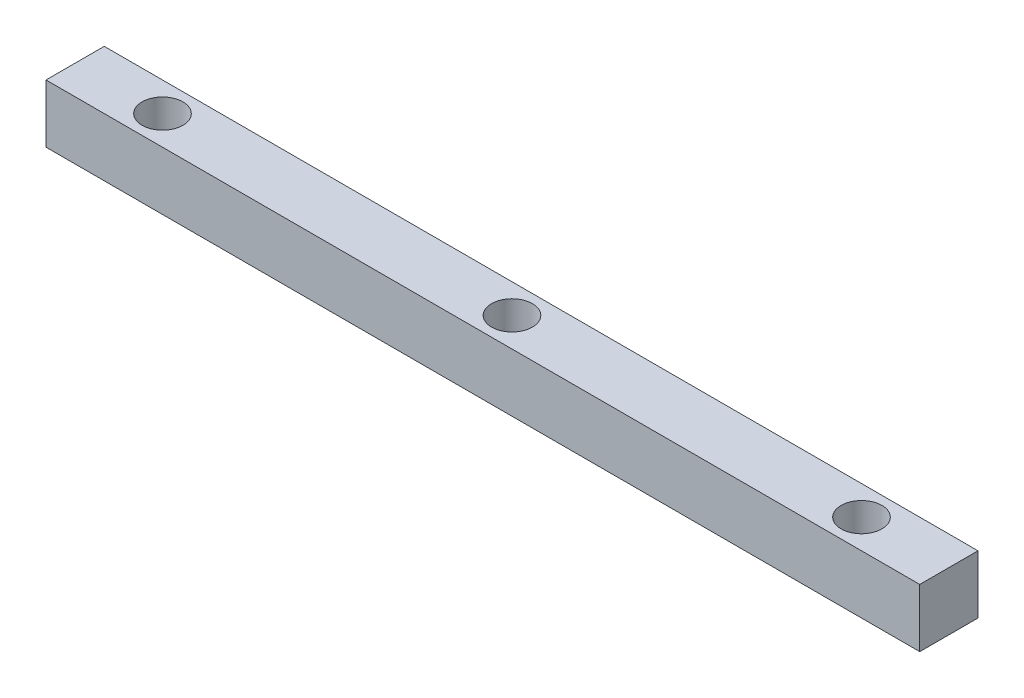
ISO-10303-21;
HEADER;
FILE_DESCRIPTION(('STEP AP214'),'2;1');
FILE_NAME('part.step','',(''),(''),'','','');
FILE_SCHEMA(('AUTOMOTIVE_DESIGN { 1 0 10303 214 1 1 1 1 }'));
ENDSEC;
DATA;
#1=APPLICATION_CONTEXT('core data for automotive mechanical design processes');
#2=APPLICATION_PROTOCOL_DEFINITION('international standard','automotive_design',2000,#1);
#3=PRODUCT_CONTEXT('',#1,'mechanical');
#4=PRODUCT('Part','Part','',(#3));
#5=PRODUCT_RELATED_PRODUCT_CATEGORY('part','',(#4));
#6=PRODUCT_DEFINITION_FORMATION('','',#4);
#7=PRODUCT_DEFINITION_CONTEXT('part definition',#1,'design');
#8=PRODUCT_DEFINITION('design','',#6,#7);
#9=PRODUCT_DEFINITION_SHAPE('','',#8);
#10=(LENGTH_UNIT() NAMED_UNIT(*) SI_UNIT(.MILLI.,.METRE.));
#11=(NAMED_UNIT(*) PLANE_ANGLE_UNIT() SI_UNIT($,.RADIAN.));
#12=(NAMED_UNIT(*) SI_UNIT($,.STERADIAN.) SOLID_ANGLE_UNIT());
#13=UNCERTAINTY_MEASURE_WITH_UNIT(LENGTH_MEASURE(1.E-05),#10,'distance_accuracy_value','');
#14=(GEOMETRIC_REPRESENTATION_CONTEXT(3) GLOBAL_UNCERTAINTY_ASSIGNED_CONTEXT((#13)) GLOBAL_UNIT_ASSIGNED_CONTEXT((#10,
#11,#12)) REPRESENTATION_CONTEXT('',''));
#15=CARTESIAN_POINT('',(0.,0.,0.));
#16=DIRECTION('',(0.,0.,1.));
#17=DIRECTION('',(1.,0.,0.));
#18=AXIS2_PLACEMENT_3D('',#15,#16,#17);
#19=CARTESIAN_POINT('',(0.,10.,0.));
#20=DIRECTION('',(1.,0.,0.));
#21=DIRECTION('',(0.,0.,-1.));
#22=AXIS2_PLACEMENT_3D('',#19,#20,#21);
#23=PLANE('',#22);
#24=DIRECTION('',(0.,0.,1.));
#25=VECTOR('',#24,1.);
#26=CARTESIAN_POINT('',(0.,0.,0.));
#27=LINE('',#26,#25);
#28=CARTESIAN_POINT('',(0.,0.,0.));
#29=VERTEX_POINT('',#28);
#30=CARTESIAN_POINT('',(0.,0.,10.));
#31=VERTEX_POINT('',#30);
#32=EDGE_CURVE('E96',#29,#31,#27,.T.);
#33=ORIENTED_EDGE('',*,*,#32,.T.);
#34=DIRECTION('',(0.,-1.,0.));
#35=VECTOR('',#34,1.);
#36=CARTESIAN_POINT('',(0.,10.,10.));
#37=LINE('',#36,#35);
#38=CARTESIAN_POINT('',(0.,10.,10.));
#39=VERTEX_POINT('',#38);
#40=EDGE_CURVE('E11',#39,#31,#37,.T.);
#41=ORIENTED_EDGE('',*,*,#40,.F.);
#42=DIRECTION('',(0.,0.,1.));
#43=VECTOR('',#42,1.);
#44=CARTESIAN_POINT('',(0.,10.,0.));
#45=LINE('',#44,#43);
#46=CARTESIAN_POINT('',(0.,10.,0.));
#47=VERTEX_POINT('',#46);
#48=EDGE_CURVE('E84',#47,#39,#45,.T.);
#49=ORIENTED_EDGE('',*,*,#48,.F.);
#50=DIRECTION('',(0.,-1.,0.));
#51=VECTOR('',#50,1.);
#52=CARTESIAN_POINT('',(0.,10.,0.));
#53=LINE('',#52,#51);
#54=EDGE_CURVE('E92',#47,#29,#53,.T.);
#55=ORIENTED_EDGE('',*,*,#54,.T.);
#56=EDGE_LOOP('',(#33,#41,#49,#55));
#57=FACE_BOUND('',#56,.T.);
#58=ADVANCED_FACE('F33',(#57),#23,.F.);
#59=CARTESIAN_POINT('',(0.,10.,10.));
#60=DIRECTION('',(0.,0.,-1.));
#61=DIRECTION('',(-1.,0.,0.));
#62=AXIS2_PLACEMENT_3D('',#59,#60,#61);
#63=PLANE('',#62);
#64=DIRECTION('',(1.,0.,0.));
#65=VECTOR('',#64,1.);
#66=CARTESIAN_POINT('',(0.,0.,10.));
#67=LINE('',#66,#65);
#68=CARTESIAN_POINT('',(150.,0.,10.));
#69=VERTEX_POINT('',#68);
#70=EDGE_CURVE('E88',#31,#69,#67,.T.);
#71=ORIENTED_EDGE('',*,*,#70,.T.);
#72=DIRECTION('',(0.,-1.,0.));
#73=VECTOR('',#72,1.);
#74=CARTESIAN_POINT('',(150.,10.,10.));
#75=LINE('',#74,#73);
#76=CARTESIAN_POINT('',(150.,10.,10.));
#77=VERTEX_POINT('',#76);
#78=EDGE_CURVE('E41',#77,#69,#75,.T.);
#79=ORIENTED_EDGE('',*,*,#78,.F.);
#80=DIRECTION('',(1.,0.,0.));
#81=VECTOR('',#80,1.);
#82=CARTESIAN_POINT('',(0.,10.,10.));
#83=LINE('',#82,#81);
#84=EDGE_CURVE('E79',#39,#77,#83,.T.);
#85=ORIENTED_EDGE('',*,*,#84,.F.);
#86=ORIENTED_EDGE('',*,*,#40,.T.);
#87=EDGE_LOOP('',(#71,#79,#85,#86));
#88=FACE_BOUND('',#87,.T.);
#89=ADVANCED_FACE('F87',(#88),#63,.F.);
#90=CARTESIAN_POINT('',(150.,10.,0.));
#91=DIRECTION('',(-1.,0.,0.));
#92=DIRECTION('',(0.,0.,1.));
#93=AXIS2_PLACEMENT_3D('',#90,#91,#92);
#94=PLANE('',#93);
#95=DIRECTION('',(0.,0.,-1.));
#96=VECTOR('',#95,1.);
#97=CARTESIAN_POINT('',(150.,0.,0.));
#98=LINE('',#97,#96);
#99=CARTESIAN_POINT('',(150.,0.,0.));
#100=VERTEX_POINT('',#99);
#101=EDGE_CURVE('E66',#69,#100,#98,.T.);
#102=ORIENTED_EDGE('',*,*,#101,.T.);
#103=DIRECTION('',(0.,-1.,0.));
#104=VECTOR('',#103,1.);
#105=CARTESIAN_POINT('',(150.,10.,0.));
#106=LINE('',#105,#104);
#107=CARTESIAN_POINT('',(150.,10.,0.));
#108=VERTEX_POINT('',#107);
#109=EDGE_CURVE('E89',#108,#100,#106,.T.);
#110=ORIENTED_EDGE('',*,*,#109,.F.);
#111=DIRECTION('',(0.,0.,-1.));
#112=VECTOR('',#111,1.);
#113=CARTESIAN_POINT('',(150.,10.,0.));
#114=LINE('',#113,#112);
#115=EDGE_CURVE('E82',#77,#108,#114,.T.);
#116=ORIENTED_EDGE('',*,*,#115,.F.);
#117=ORIENTED_EDGE('',*,*,#78,.T.);
#118=EDGE_LOOP('',(#102,#110,#116,#117));
#119=FACE_BOUND('',#118,.T.);
#120=ADVANCED_FACE('F90',(#119),#94,.F.);
#121=CARTESIAN_POINT('',(0.,10.,0.));
#122=DIRECTION('',(0.,0.,1.));
#123=DIRECTION('',(1.,0.,0.));
#124=AXIS2_PLACEMENT_3D('',#121,#122,#123);
#125=PLANE('',#124);
#126=DIRECTION('',(-1.,0.,0.));
#127=VECTOR('',#126,1.);
#128=CARTESIAN_POINT('',(0.,0.,0.));
#129=LINE('',#128,#127);
#130=EDGE_CURVE('E72',#100,#29,#129,.T.);
#131=ORIENTED_EDGE('',*,*,#130,.T.);
#132=ORIENTED_EDGE('',*,*,#54,.F.);
#133=DIRECTION('',(-1.,0.,0.));
#134=VECTOR('',#133,1.);
#135=CARTESIAN_POINT('',(0.,10.,0.));
#136=LINE('',#135,#134);
#137=EDGE_CURVE('E49',#108,#47,#136,.T.);
#138=ORIENTED_EDGE('',*,*,#137,.F.);
#139=ORIENTED_EDGE('',*,*,#109,.T.);
#140=EDGE_LOOP('',(#131,#132,#138,#139));
#141=FACE_BOUND('',#140,.T.);
#142=ADVANCED_FACE('F104',(#141),#125,.F.);
#143=CARTESIAN_POINT('',(0.,10.,0.));
#144=DIRECTION('',(0.,1.,0.));
#145=DIRECTION('',(0.,0.,1.));
#146=AXIS2_PLACEMENT_3D('',#143,#144,#145);
#147=PLANE('',#146);
#148=CARTESIAN_POINT('',(75.,10.,5.));
#149=DIRECTION('',(0.,1.,0.));
#150=DIRECTION('',(0.,0.,1.));
#151=AXIS2_PLACEMENT_3D('',#148,#149,#150);
#152=CIRCLE('',#151,3.50000000000001);
#153=CARTESIAN_POINT('',(75.,10.,8.50000000000001));
#154=VERTEX_POINT('',#153);
#155=EDGE_CURVE('E122',#154,#154,#152,.T.);
#156=ORIENTED_EDGE('',*,*,#155,.F.);
#157=EDGE_LOOP('',(#156));
#158=FACE_BOUND('',#157,.T.);
#159=CARTESIAN_POINT('',(135.,10.,5.));
#160=DIRECTION('',(0.,1.,0.));
#161=DIRECTION('',(0.,0.,1.));
#162=AXIS2_PLACEMENT_3D('',#159,#160,#161);
#163=CIRCLE('',#162,3.49999999999999);
#164=CARTESIAN_POINT('',(135.,10.,8.49999999999999));
#165=VERTEX_POINT('',#164);
#166=EDGE_CURVE('E116',#165,#165,#163,.T.);
#167=ORIENTED_EDGE('',*,*,#166,.F.);
#168=EDGE_LOOP('',(#167));
#169=FACE_BOUND('',#168,.T.);
#170=CARTESIAN_POINT('',(15.,10.,5.));
#171=DIRECTION('',(0.,1.,0.));
#172=DIRECTION('',(0.,0.,1.));
#173=AXIS2_PLACEMENT_3D('',#170,#171,#172);
#174=CIRCLE('',#173,3.5);
#175=CARTESIAN_POINT('',(15.,10.,8.5));
#176=VERTEX_POINT('',#175);
#177=EDGE_CURVE('E110',#176,#176,#174,.T.);
#178=ORIENTED_EDGE('',*,*,#177,.F.);
#179=EDGE_LOOP('',(#178));
#180=FACE_BOUND('',#179,.T.);
#181=ORIENTED_EDGE('',*,*,#48,.T.);
#182=ORIENTED_EDGE('',*,*,#84,.T.);
#183=ORIENTED_EDGE('',*,*,#115,.T.);
#184=ORIENTED_EDGE('',*,*,#137,.T.);
#185=EDGE_LOOP('',(#181,#182,#183,#184));
#186=FACE_BOUND('',#185,.T.);
#187=ADVANCED_FACE('F80',(#158,#169,#180,#186),#147,.T.);
#188=CARTESIAN_POINT('',(0.,0.,0.));
#189=DIRECTION('',(0.,1.,0.));
#190=DIRECTION('',(0.,0.,1.));
#191=AXIS2_PLACEMENT_3D('',#188,#189,#190);
#192=PLANE('',#191);
#193=CARTESIAN_POINT('',(75.,0.,5.));
#194=DIRECTION('',(0.,1.,0.));
#195=DIRECTION('',(0.,0.,1.));
#196=AXIS2_PLACEMENT_3D('',#193,#194,#195);
#197=CIRCLE('',#196,3.50000000000001);
#198=CARTESIAN_POINT('',(75.,0.,8.50000000000001));
#199=VERTEX_POINT('',#198);
#200=EDGE_CURVE('E113',#199,#199,#197,.T.);
#201=ORIENTED_EDGE('',*,*,#200,.T.);
#202=EDGE_LOOP('',(#201));
#203=FACE_BOUND('',#202,.T.);
#204=CARTESIAN_POINT('',(135.,0.,5.));
#205=DIRECTION('',(0.,1.,0.));
#206=DIRECTION('',(0.,0.,1.));
#207=AXIS2_PLACEMENT_3D('',#204,#205,#206);
#208=CIRCLE('',#207,3.49999999999999);
#209=CARTESIAN_POINT('',(135.,0.,8.49999999999999));
#210=VERTEX_POINT('',#209);
#211=EDGE_CURVE('E119',#210,#210,#208,.T.);
#212=ORIENTED_EDGE('',*,*,#211,.T.);
#213=EDGE_LOOP('',(#212));
#214=FACE_BOUND('',#213,.T.);
#215=CARTESIAN_POINT('',(15.,0.,5.));
#216=DIRECTION('',(0.,1.,0.));
#217=DIRECTION('',(0.,0.,1.));
#218=AXIS2_PLACEMENT_3D('',#215,#216,#217);
#219=CIRCLE('',#218,3.5);
#220=CARTESIAN_POINT('',(15.,0.,8.5));
#221=VERTEX_POINT('',#220);
#222=EDGE_CURVE('E99',#221,#221,#219,.T.);
#223=ORIENTED_EDGE('',*,*,#222,.T.);
#224=EDGE_LOOP('',(#223));
#225=FACE_BOUND('',#224,.T.);
#226=ORIENTED_EDGE('',*,*,#32,.F.);
#227=ORIENTED_EDGE('',*,*,#130,.F.);
#228=ORIENTED_EDGE('',*,*,#101,.F.);
#229=ORIENTED_EDGE('',*,*,#70,.F.);
#230=EDGE_LOOP('',(#226,#227,#228,#229));
#231=FACE_BOUND('',#230,.T.);
#232=ADVANCED_FACE('F107',(#203,#214,#225,#231),#192,.F.);
#233=CARTESIAN_POINT('',(15.,0.,5.));
#234=DIRECTION('',(0.,1.,0.));
#235=DIRECTION('',(0.,0.,1.));
#236=AXIS2_PLACEMENT_3D('',#233,#234,#235);
#237=CYLINDRICAL_SURFACE('',#236,3.5);
#238=ORIENTED_EDGE('',*,*,#222,.F.);
#239=EDGE_LOOP('',(#238));
#240=FACE_BOUND('',#239,.T.);
#241=ORIENTED_EDGE('',*,*,#177,.T.);
#242=EDGE_LOOP('',(#241));
#243=FACE_BOUND('',#242,.T.);
#244=ADVANCED_FACE('F144',(#240,#243),#237,.F.);
#245=CARTESIAN_POINT('',(135.,0.,5.));
#246=DIRECTION('',(0.,1.,0.));
#247=DIRECTION('',(0.,0.,1.));
#248=AXIS2_PLACEMENT_3D('',#245,#246,#247);
#249=CYLINDRICAL_SURFACE('',#248,3.49999999999999);
#250=ORIENTED_EDGE('',*,*,#211,.F.);
#251=EDGE_LOOP('',(#250));
#252=FACE_BOUND('',#251,.T.);
#253=ORIENTED_EDGE('',*,*,#166,.T.);
#254=EDGE_LOOP('',(#253));
#255=FACE_BOUND('',#254,.T.);
#256=ADVANCED_FACE('F133',(#252,#255),#249,.F.);
#257=CARTESIAN_POINT('',(75.,0.,5.));
#258=DIRECTION('',(0.,1.,0.));
#259=DIRECTION('',(0.,0.,1.));
#260=AXIS2_PLACEMENT_3D('',#257,#258,#259);
#261=CYLINDRICAL_SURFACE('',#260,3.50000000000001);
#262=ORIENTED_EDGE('',*,*,#200,.F.);
#263=EDGE_LOOP('',(#262));
#264=FACE_BOUND('',#263,.T.);
#265=ORIENTED_EDGE('',*,*,#155,.T.);
#266=EDGE_LOOP('',(#265));
#267=FACE_BOUND('',#266,.T.);
#268=ADVANCED_FACE('F130',(#264,#267),#261,.F.);
#269=CLOSED_SHELL('',(#58,#89,#120,#142,#187,#232,#244,#256,#268));
#270=MANIFOLD_SOLID_BREP('B2',#269);
#271=ADVANCED_BREP_SHAPE_REPRESENTATION('',(#18,#270),#14);
#272=SHAPE_DEFINITION_REPRESENTATION(#9,#271);
ENDSEC;
END-ISO-10303-21;
